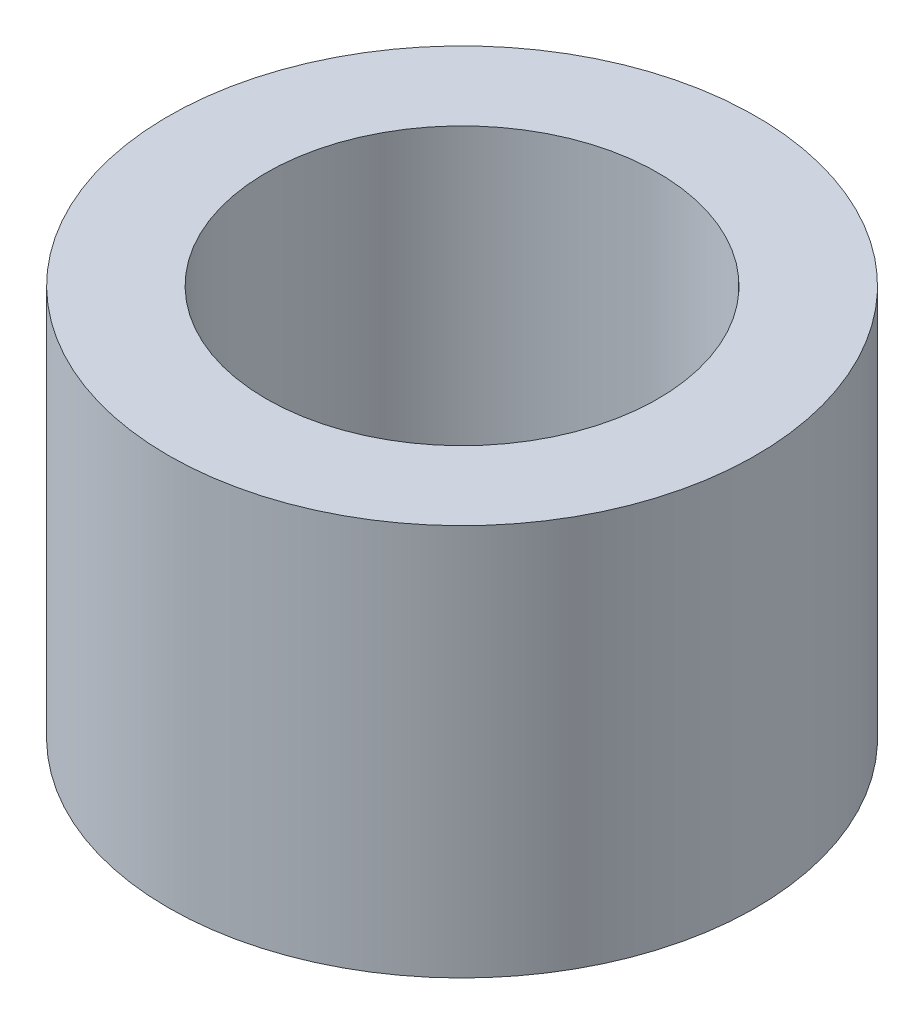
ISO-10303-21;
HEADER;
FILE_DESCRIPTION(('STEP AP214'),'2;1');
FILE_NAME('part.step','',(''),(''),'','','');
FILE_SCHEMA(('AUTOMOTIVE_DESIGN { 1 0 10303 214 1 1 1 1 }'));
ENDSEC;
DATA;
#1=APPLICATION_CONTEXT('core data for automotive mechanical design processes');
#2=APPLICATION_PROTOCOL_DEFINITION('international standard','automotive_design',2000,#1);
#3=PRODUCT_CONTEXT('',#1,'mechanical');
#4=PRODUCT('Part','Part','',(#3));
#5=PRODUCT_RELATED_PRODUCT_CATEGORY('part','',(#4));
#6=PRODUCT_DEFINITION_FORMATION('','',#4);
#7=PRODUCT_DEFINITION_CONTEXT('part definition',#1,'design');
#8=PRODUCT_DEFINITION('design','',#6,#7);
#9=PRODUCT_DEFINITION_SHAPE('','',#8);
#10=(LENGTH_UNIT() NAMED_UNIT(*) SI_UNIT(.MILLI.,.METRE.));
#11=(NAMED_UNIT(*) PLANE_ANGLE_UNIT() SI_UNIT($,.RADIAN.));
#12=(NAMED_UNIT(*) SI_UNIT($,.STERADIAN.) SOLID_ANGLE_UNIT());
#13=UNCERTAINTY_MEASURE_WITH_UNIT(LENGTH_MEASURE(1.E-05),#10,'distance_accuracy_value','');
#14=(GEOMETRIC_REPRESENTATION_CONTEXT(3) GLOBAL_UNCERTAINTY_ASSIGNED_CONTEXT((#13)) GLOBAL_UNIT_ASSIGNED_CONTEXT((#10,
#11,#12)) REPRESENTATION_CONTEXT('',''));
#15=CARTESIAN_POINT('',(0.,0.,0.));
#16=DIRECTION('',(0.,0.,1.));
#17=DIRECTION('',(1.,0.,0.));
#18=AXIS2_PLACEMENT_3D('',#15,#16,#17);
#19=CARTESIAN_POINT('',(0.,3.175,0.));
#20=DIRECTION('',(0.,1.,0.));
#21=DIRECTION('',(0.,0.,1.));
#22=AXIS2_PLACEMENT_3D('',#19,#20,#21);
#23=PLANE('',#22);
#24=CARTESIAN_POINT('',(0.,3.175,0.));
#25=DIRECTION('',(0.,1.,0.));
#26=DIRECTION('',(0.,0.,1.));
#27=AXIS2_PLACEMENT_3D('',#24,#25,#26);
#28=CIRCLE('',#27,2.38125);
#29=CARTESIAN_POINT('',(0.,3.175,2.38125));
#30=VERTEX_POINT('',#29);
#31=EDGE_CURVE('E10',#30,#30,#28,.T.);
#32=ORIENTED_EDGE('',*,*,#31,.T.);
#33=EDGE_LOOP('',(#32));
#34=FACE_BOUND('',#33,.T.);
#35=CARTESIAN_POINT('',(0.,3.175,0.));
#36=DIRECTION('',(0.,1.,0.));
#37=DIRECTION('',(0.,0.,1.));
#38=AXIS2_PLACEMENT_3D('',#35,#36,#37);
#39=CIRCLE('',#38,1.5875);
#40=CARTESIAN_POINT('',(0.,3.175,1.5875));
#41=VERTEX_POINT('',#40);
#42=EDGE_CURVE('E41',#41,#41,#39,.T.);
#43=ORIENTED_EDGE('',*,*,#42,.F.);
#44=EDGE_LOOP('',(#43));
#45=FACE_BOUND('',#44,.T.);
#46=ADVANCED_FACE('F30',(#34,#45),#23,.T.);
#47=CARTESIAN_POINT('',(0.,0.,0.));
#48=DIRECTION('',(0.,1.,0.));
#49=DIRECTION('',(0.,0.,1.));
#50=AXIS2_PLACEMENT_3D('',#47,#48,#49);
#51=PLANE('',#50);
#52=CARTESIAN_POINT('',(0.,0.,0.));
#53=DIRECTION('',(0.,1.,0.));
#54=DIRECTION('',(0.,0.,1.));
#55=AXIS2_PLACEMENT_3D('',#52,#53,#54);
#56=CIRCLE('',#55,2.38125);
#57=CARTESIAN_POINT('',(0.,0.,2.38125));
#58=VERTEX_POINT('',#57);
#59=EDGE_CURVE('E34',#58,#58,#56,.T.);
#60=ORIENTED_EDGE('',*,*,#59,.F.);
#61=EDGE_LOOP('',(#60));
#62=FACE_BOUND('',#61,.T.);
#63=CARTESIAN_POINT('',(0.,0.,0.));
#64=DIRECTION('',(0.,1.,0.));
#65=DIRECTION('',(0.,0.,1.));
#66=AXIS2_PLACEMENT_3D('',#63,#64,#65);
#67=CIRCLE('',#66,1.5875);
#68=CARTESIAN_POINT('',(0.,0.,1.5875));
#69=VERTEX_POINT('',#68);
#70=EDGE_CURVE('E43',#69,#69,#67,.T.);
#71=ORIENTED_EDGE('',*,*,#70,.T.);
#72=EDGE_LOOP('',(#71));
#73=FACE_BOUND('',#72,.T.);
#74=ADVANCED_FACE('F53',(#62,#73),#51,.F.);
#75=CARTESIAN_POINT('',(0.,3.175,0.));
#76=DIRECTION('',(0.,-1.,0.));
#77=DIRECTION('',(0.,0.,-1.));
#78=AXIS2_PLACEMENT_3D('',#75,#76,#77);
#79=CYLINDRICAL_SURFACE('',#78,2.38125);
#80=ORIENTED_EDGE('',*,*,#31,.F.);
#81=EDGE_LOOP('',(#80));
#82=FACE_BOUND('',#81,.T.);
#83=ORIENTED_EDGE('',*,*,#59,.T.);
#84=EDGE_LOOP('',(#83));
#85=FACE_BOUND('',#84,.T.);
#86=ADVANCED_FACE('F32',(#82,#85),#79,.T.);
#87=CARTESIAN_POINT('',(0.,3.175,0.));
#88=DIRECTION('',(0.,-1.,0.));
#89=DIRECTION('',(0.,0.,-1.));
#90=AXIS2_PLACEMENT_3D('',#87,#88,#89);
#91=CYLINDRICAL_SURFACE('',#90,1.5875);
#92=ORIENTED_EDGE('',*,*,#42,.T.);
#93=EDGE_LOOP('',(#92));
#94=FACE_BOUND('',#93,.T.);
#95=ORIENTED_EDGE('',*,*,#70,.F.);
#96=EDGE_LOOP('',(#95));
#97=FACE_BOUND('',#96,.T.);
#98=ADVANCED_FACE('F49',(#94,#97),#91,.F.);
#99=CLOSED_SHELL('',(#46,#74,#86,#98));
#100=MANIFOLD_SOLID_BREP('B2',#99);
#101=ADVANCED_BREP_SHAPE_REPRESENTATION('',(#18,#100),#14);
#102=SHAPE_DEFINITION_REPRESENTATION(#9,#101);
ENDSEC;
END-ISO-10303-21;
